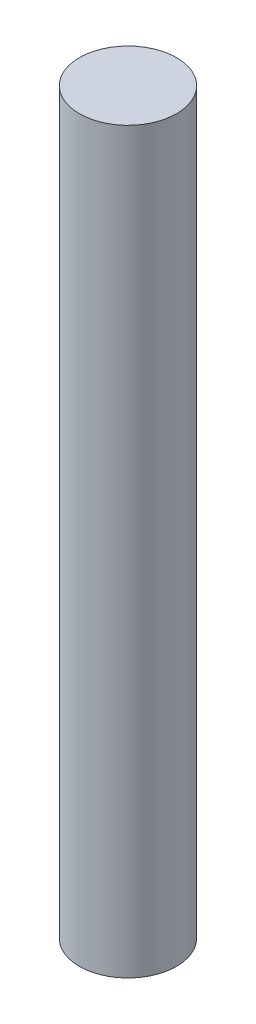
ISO-10303-21;
HEADER;
FILE_DESCRIPTION(('STEP AP214'),'2;1');
FILE_NAME('part.step','',(''),(''),'','','');
FILE_SCHEMA(('AUTOMOTIVE_DESIGN { 1 0 10303 214 1 1 1 1 }'));
ENDSEC;
DATA;
#1=APPLICATION_CONTEXT('core data for automotive mechanical design processes');
#2=APPLICATION_PROTOCOL_DEFINITION('international standard','automotive_design',2000,#1);
#3=PRODUCT_CONTEXT('',#1,'mechanical');
#4=PRODUCT('Part','Part','',(#3));
#5=PRODUCT_RELATED_PRODUCT_CATEGORY('part','',(#4));
#6=PRODUCT_DEFINITION_FORMATION('','',#4);
#7=PRODUCT_DEFINITION_CONTEXT('part definition',#1,'design');
#8=PRODUCT_DEFINITION('design','',#6,#7);
#9=PRODUCT_DEFINITION_SHAPE('','',#8);
#10=(LENGTH_UNIT() NAMED_UNIT(*) SI_UNIT(.MILLI.,.METRE.));
#11=(NAMED_UNIT(*) PLANE_ANGLE_UNIT() SI_UNIT($,.RADIAN.));
#12=(NAMED_UNIT(*) SI_UNIT($,.STERADIAN.) SOLID_ANGLE_UNIT());
#13=UNCERTAINTY_MEASURE_WITH_UNIT(LENGTH_MEASURE(1.E-05),#10,'distance_accuracy_value','');
#14=(GEOMETRIC_REPRESENTATION_CONTEXT(3) GLOBAL_UNCERTAINTY_ASSIGNED_CONTEXT((#13)) GLOBAL_UNIT_ASSIGNED_CONTEXT((#10,
#11,#12)) REPRESENTATION_CONTEXT('',''));
#15=CARTESIAN_POINT('',(0.,0.,0.));
#16=DIRECTION('',(0.,0.,1.));
#17=DIRECTION('',(1.,0.,0.));
#18=AXIS2_PLACEMENT_3D('',#15,#16,#17);
#19=CARTESIAN_POINT('',(0.,38.,0.));
#20=DIRECTION('',(0.,-1.,0.));
#21=DIRECTION('',(0.,0.,-1.));
#22=AXIS2_PLACEMENT_3D('',#19,#20,#21);
#23=CYLINDRICAL_SURFACE('',#22,2.5);
#24=CARTESIAN_POINT('',(0.,38.,0.));
#25=DIRECTION('',(0.,1.,0.));
#26=DIRECTION('',(0.,0.,1.));
#27=AXIS2_PLACEMENT_3D('',#24,#25,#26);
#28=CIRCLE('',#27,2.5);
#29=CARTESIAN_POINT('',(0.,38.,2.5));
#30=VERTEX_POINT('',#29);
#31=EDGE_CURVE('E10',#30,#30,#28,.T.);
#32=ORIENTED_EDGE('',*,*,#31,.F.);
#33=EDGE_LOOP('',(#32));
#34=FACE_BOUND('',#33,.T.);
#35=CARTESIAN_POINT('',(0.,0.,0.));
#36=DIRECTION('',(0.,1.,0.));
#37=DIRECTION('',(0.,0.,1.));
#38=AXIS2_PLACEMENT_3D('',#35,#36,#37);
#39=CIRCLE('',#38,2.5);
#40=CARTESIAN_POINT('',(0.,0.,2.5));
#41=VERTEX_POINT('',#40);
#42=EDGE_CURVE('E34',#41,#41,#39,.T.);
#43=ORIENTED_EDGE('',*,*,#42,.T.);
#44=EDGE_LOOP('',(#43));
#45=FACE_BOUND('',#44,.T.);
#46=ADVANCED_FACE('F31',(#34,#45),#23,.T.);
#47=CARTESIAN_POINT('',(0.,38.,0.));
#48=DIRECTION('',(0.,1.,0.));
#49=DIRECTION('',(0.,0.,1.));
#50=AXIS2_PLACEMENT_3D('',#47,#48,#49);
#51=PLANE('',#50);
#52=ORIENTED_EDGE('',*,*,#31,.T.);
#53=EDGE_LOOP('',(#52));
#54=FACE_BOUND('',#53,.T.);
#55=ADVANCED_FACE('F46',(#54),#51,.T.);
#56=CARTESIAN_POINT('',(0.,0.,0.));
#57=DIRECTION('',(0.,1.,0.));
#58=DIRECTION('',(0.,0.,1.));
#59=AXIS2_PLACEMENT_3D('',#56,#57,#58);
#60=PLANE('',#59);
#61=ORIENTED_EDGE('',*,*,#42,.F.);
#62=EDGE_LOOP('',(#61));
#63=FACE_BOUND('',#62,.T.);
#64=ADVANCED_FACE('F44',(#63),#60,.F.);
#65=CLOSED_SHELL('',(#46,#55,#64));
#66=MANIFOLD_SOLID_BREP('B2',#65);
#67=ADVANCED_BREP_SHAPE_REPRESENTATION('',(#18,#66),#14);
#68=SHAPE_DEFINITION_REPRESENTATION(#9,#67);
ENDSEC;
END-ISO-10303-21;
